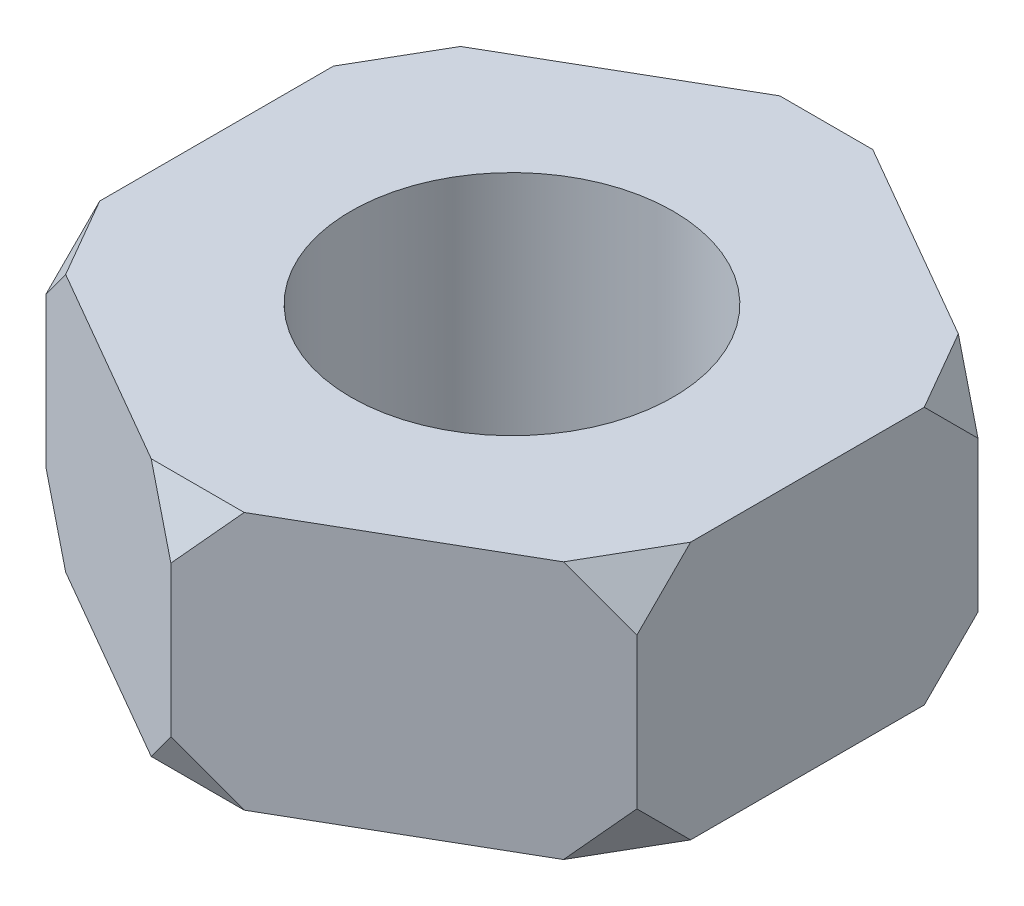
ISO-10303-21;
HEADER;
FILE_DESCRIPTION(('STEP AP214'),'2;1');
FILE_NAME('part.step','',(''),(''),'','','');
FILE_SCHEMA(('AUTOMOTIVE_DESIGN { 1 0 10303 214 1 1 1 1 }'));
ENDSEC;
DATA;
#1=APPLICATION_CONTEXT('core data for automotive mechanical design processes');
#2=APPLICATION_PROTOCOL_DEFINITION('international standard','automotive_design',2000,#1);
#3=PRODUCT_CONTEXT('',#1,'mechanical');
#4=PRODUCT('Part','Part','',(#3));
#5=PRODUCT_RELATED_PRODUCT_CATEGORY('part','',(#4));
#6=PRODUCT_DEFINITION_FORMATION('','',#4);
#7=PRODUCT_DEFINITION_CONTEXT('part definition',#1,'design');
#8=PRODUCT_DEFINITION('design','',#6,#7);
#9=PRODUCT_DEFINITION_SHAPE('','',#8);
#10=(LENGTH_UNIT() NAMED_UNIT(*) SI_UNIT(.MILLI.,.METRE.));
#11=(NAMED_UNIT(*) PLANE_ANGLE_UNIT() SI_UNIT($,.RADIAN.));
#12=(NAMED_UNIT(*) SI_UNIT($,.STERADIAN.) SOLID_ANGLE_UNIT());
#13=UNCERTAINTY_MEASURE_WITH_UNIT(LENGTH_MEASURE(1.E-05),#10,'distance_accuracy_value','');
#14=(GEOMETRIC_REPRESENTATION_CONTEXT(3) GLOBAL_UNCERTAINTY_ASSIGNED_CONTEXT((#13)) GLOBAL_UNIT_ASSIGNED_CONTEXT((#10,
#11,#12)) REPRESENTATION_CONTEXT('',''));
#15=CARTESIAN_POINT('',(0.,0.,0.));
#16=DIRECTION('',(0.,0.,1.));
#17=DIRECTION('',(1.,0.,0.));
#18=AXIS2_PLACEMENT_3D('',#15,#16,#17);
#19=CARTESIAN_POINT('',(2.75000000000002,2.4,1.58771324027145));
#20=DIRECTION('',(-1.,0.,0.));
#21=DIRECTION('',(0.,0.,1.));
#22=AXIS2_PLACEMENT_3D('',#19,#20,#21);
#23=PLANE('',#22);
#24=DIRECTION('',(0.,-1.,0.));
#25=VECTOR('',#24,1.);
#26=CARTESIAN_POINT('',(2.75000000000002,2.4,1.58771324027145));
#27=LINE('',#26,#25);
#28=CARTESIAN_POINT('',(2.75000000000002,1.9,1.58771324027145));
#29=VERTEX_POINT('',#28);
#30=CARTESIAN_POINT('',(2.75000000000002,0.500000000000003,1.58771324027145));
#31=VERTEX_POINT('',#30);
#32=EDGE_CURVE('E171',#29,#31,#27,.T.);
#33=ORIENTED_EDGE('',*,*,#32,.T.);
#34=DIRECTION('',(0.,-0.707106781186548,-0.707106781186547));
#35=VECTOR('',#34,1.);
#36=CARTESIAN_POINT('',(2.75000000000003,1.45,2.53771324027144));
#37=LINE('',#36,#35);
#38=CARTESIAN_POINT('',(2.75000000000001,0.,1.08771324027144));
#39=VERTEX_POINT('',#38);
#40=EDGE_CURVE('E11',#31,#39,#37,.T.);
#41=ORIENTED_EDGE('',*,*,#40,.T.);
#42=DIRECTION('',(0.,0.,-1.));
#43=VECTOR('',#42,1.);
#44=CARTESIAN_POINT('',(2.75000000000002,0.,1.58771324027145));
#45=LINE('',#44,#43);
#46=CARTESIAN_POINT('',(2.74999999999999,0.,-1.0877132402715));
#47=VERTEX_POINT('',#46);
#48=EDGE_CURVE('E330',#39,#47,#45,.T.);
#49=ORIENTED_EDGE('',*,*,#48,.T.);
#50=DIRECTION('',(0.,-0.707106781186547,0.707106781186548));
#51=VECTOR('',#50,1.);
#52=CARTESIAN_POINT('',(2.74999999999999,-0.137713240271475,-0.950000000000027));
#53=LINE('',#52,#51);
#54=CARTESIAN_POINT('',(2.74999999999998,0.500000000000003,-1.5877132402715));
#55=VERTEX_POINT('',#54);
#56=EDGE_CURVE('E321',#55,#47,#53,.T.);
#57=ORIENTED_EDGE('',*,*,#56,.F.);
#58=DIRECTION('',(0.,-1.,0.));
#59=VECTOR('',#58,1.);
#60=CARTESIAN_POINT('',(2.74999999999998,2.4,-1.5877132402715));
#61=LINE('',#60,#59);
#62=CARTESIAN_POINT('',(2.74999999999998,1.9,-1.5877132402715));
#63=VERTEX_POINT('',#62);
#64=EDGE_CURVE('E180',#63,#55,#61,.T.);
#65=ORIENTED_EDGE('',*,*,#64,.F.);
#66=DIRECTION('',(0.,-0.707106781186547,-0.707106781186548));
#67=VECTOR('',#66,1.);
#68=CARTESIAN_POINT('',(2.75,3.73771324027148,0.249999999999971));
#69=LINE('',#68,#67);
#70=CARTESIAN_POINT('',(2.74999999999999,2.4,-1.08771324027151));
#71=VERTEX_POINT('',#70);
#72=EDGE_CURVE('E254',#71,#63,#69,.T.);
#73=ORIENTED_EDGE('',*,*,#72,.F.);
#74=DIRECTION('',(0.,0.,-1.));
#75=VECTOR('',#74,1.);
#76=CARTESIAN_POINT('',(2.75000000000002,2.4,1.58771324027145));
#77=LINE('',#76,#75);
#78=CARTESIAN_POINT('',(2.75000000000001,2.4,1.08771324027144));
#79=VERTEX_POINT('',#78);
#80=EDGE_CURVE('E186',#79,#71,#77,.T.);
#81=ORIENTED_EDGE('',*,*,#80,.F.);
#82=DIRECTION('',(0.,0.707106781186548,-0.707106781186547));
#83=VECTOR('',#82,1.);
#84=CARTESIAN_POINT('',(2.75000000000001,2.15,1.33771324027145));
#85=LINE('',#84,#83);
#86=EDGE_CURVE('E177',#29,#79,#85,.T.);
#87=ORIENTED_EDGE('',*,*,#86,.F.);
#88=EDGE_LOOP('',(#33,#41,#49,#57,#65,#73,#81,#87));
#89=FACE_BOUND('',#88,.T.);
#90=ADVANCED_FACE('F39',(#89),#23,.F.);
#91=CARTESIAN_POINT('',(0.,2.4,3.17542648054294));
#92=DIRECTION('',(-0.500000000000007,0.,-0.866025403784435));
#93=DIRECTION('',(-0.866025403784435,0.,0.500000000000007));
#94=AXIS2_PLACEMENT_3D('',#91,#92,#93);
#95=PLANE('',#94);
#96=DIRECTION('',(0.866025403784435,0.,-0.500000000000007));
#97=VECTOR('',#96,1.);
#98=CARTESIAN_POINT('',(0.,0.,3.17542648054294));
#99=LINE('',#98,#97);
#100=CARTESIAN_POINT('',(0.433012701892239,0.,2.92542648054294));
#101=VERTEX_POINT('',#100);
#102=CARTESIAN_POINT('',(2.3169872981078,0.,1.83771324027145));
#103=VERTEX_POINT('',#102);
#104=EDGE_CURVE('E174',#101,#103,#99,.T.);
#105=ORIENTED_EDGE('',*,*,#104,.T.);
#106=DIRECTION('',(0.612372435695791,0.707106781186548,-0.353553390593278));
#107=VECTOR('',#106,1.);
#108=CARTESIAN_POINT('',(2.19772413359523,-0.137713240271472,1.90656986040719));
#109=LINE('',#108,#107);
#110=EDGE_CURVE('E48',#103,#31,#109,.T.);
#111=ORIENTED_EDGE('',*,*,#110,.T.);
#112=ORIENTED_EDGE('',*,*,#32,.F.);
#113=DIRECTION('',(0.612372435695791,-0.707106781186548,-0.353553390593278));
#114=VECTOR('',#113,1.);
#115=CARTESIAN_POINT('',(1.15849364905391,3.73771324027147,2.5065698604072));
#116=LINE('',#115,#114);
#117=CARTESIAN_POINT('',(2.3169872981078,2.4,1.83771324027145));
#118=VERTEX_POINT('',#117);
#119=EDGE_CURVE('E262',#118,#29,#116,.T.);
#120=ORIENTED_EDGE('',*,*,#119,.F.);
#121=DIRECTION('',(0.866025403784435,0.,-0.500000000000007));
#122=VECTOR('',#121,1.);
#123=CARTESIAN_POINT('',(0.,2.4,3.17542648054294));
#124=LINE('',#123,#122);
#125=CARTESIAN_POINT('',(0.433012701892241,2.4,2.92542648054294));
#126=VERTEX_POINT('',#125);
#127=EDGE_CURVE('E354',#126,#118,#124,.T.);
#128=ORIENTED_EDGE('',*,*,#127,.F.);
#129=DIRECTION('',(0.612372435695792,0.707106781186547,-0.353553390593279));
#130=VECTOR('',#129,1.);
#131=CARTESIAN_POINT('',(0.216506350946131,2.15,3.05042648054294));
#132=LINE('',#131,#130);
#133=CARTESIAN_POINT('',(0.,1.9,3.17542648054294));
#134=VERTEX_POINT('',#133);
#135=EDGE_CURVE('E207',#134,#126,#132,.T.);
#136=ORIENTED_EDGE('',*,*,#135,.F.);
#137=DIRECTION('',(0.,-1.,0.));
#138=VECTOR('',#137,1.);
#139=CARTESIAN_POINT('',(0.,2.4,3.17542648054294));
#140=LINE('',#139,#138);
#141=CARTESIAN_POINT('',(0.,0.499999999999999,3.17542648054294));
#142=VERTEX_POINT('',#141);
#143=EDGE_CURVE('E179',#134,#142,#140,.T.);
#144=ORIENTED_EDGE('',*,*,#143,.T.);
#145=DIRECTION('',(-0.612372435695792,0.707106781186547,0.353553390593279));
#146=VECTOR('',#145,1.);
#147=CARTESIAN_POINT('',(-0.822724133595191,1.45,3.65042648054295));
#148=LINE('',#147,#146);
#149=EDGE_CURVE('E275',#101,#142,#148,.T.);
#150=ORIENTED_EDGE('',*,*,#149,.F.);
#151=EDGE_LOOP('',(#105,#111,#112,#120,#128,#136,#144,#150));
#152=FACE_BOUND('',#151,.T.);
#153=ADVANCED_FACE('F170',(#152),#95,.F.);
#154=CARTESIAN_POINT('',(0.,0.,0.));
#155=DIRECTION('',(0.,1.,0.));
#156=DIRECTION('',(0.,0.,1.));
#157=AXIS2_PLACEMENT_3D('',#154,#155,#156);
#158=PLANE('',#157);
#159=CARTESIAN_POINT('',(0.,0.,0.));
#160=DIRECTION('',(0.,1.,0.));
#161=DIRECTION('',(0.,0.,1.));
#162=AXIS2_PLACEMENT_3D('',#159,#160,#161);
#163=CIRCLE('',#162,1.5);
#164=CARTESIAN_POINT('',(0.,0.,1.5));
#165=VERTEX_POINT('',#164);
#166=EDGE_CURVE('E366',#165,#165,#163,.T.);
#167=ORIENTED_EDGE('',*,*,#166,.T.);
#168=EDGE_LOOP('',(#167));
#169=FACE_BOUND('',#168,.T.);
#170=ORIENTED_EDGE('',*,*,#48,.F.);
#171=DIRECTION('',(-0.499999999999992,0.,0.866025403784443));
#172=VECTOR('',#171,1.);
#173=CARTESIAN_POINT('',(2.53349364905391,0.,1.46271324027145));
#174=LINE('',#173,#172);
#175=EDGE_CURVE('E55',#39,#103,#174,.T.);
#176=ORIENTED_EDGE('',*,*,#175,.T.);
#177=ORIENTED_EDGE('',*,*,#104,.F.);
#178=DIRECTION('',(1.,0.,0.));
#179=VECTOR('',#178,1.);
#180=CARTESIAN_POINT('',(0.,0.,2.92542648054294));
#181=LINE('',#180,#179);
#182=CARTESIAN_POINT('',(-0.433012701892199,0.,2.92542648054295));
#183=VERTEX_POINT('',#182);
#184=EDGE_CURVE('E267',#183,#101,#181,.T.);
#185=ORIENTED_EDGE('',*,*,#184,.F.);
#186=DIRECTION('',(0.866025403784442,0.,0.499999999999995));
#187=VECTOR('',#186,1.);
#188=CARTESIAN_POINT('',(-2.74999999999999,0.,1.58771324027148));
#189=LINE('',#188,#187);
#190=CARTESIAN_POINT('',(-2.31698729810777,0.,1.83771324027148));
#191=VERTEX_POINT('',#190);
#192=EDGE_CURVE('E337',#191,#183,#189,.T.);
#193=ORIENTED_EDGE('',*,*,#192,.F.);
#194=DIRECTION('',(0.500000000000004,0.,0.866025403784436));
#195=VECTOR('',#194,1.);
#196=CARTESIAN_POINT('',(-2.53349364905388,0.,1.46271324027148));
#197=LINE('',#196,#195);
#198=CARTESIAN_POINT('',(-2.75,0.,1.08771324027148));
#199=VERTEX_POINT('',#198);
#200=EDGE_CURVE('E279',#199,#191,#197,.T.);
#201=ORIENTED_EDGE('',*,*,#200,.F.);
#202=DIRECTION('',(0.,0.,1.));
#203=VECTOR('',#202,1.);
#204=CARTESIAN_POINT('',(-2.75000000000001,0.,-1.58771324027147));
#205=LINE('',#204,#203);
#206=CARTESIAN_POINT('',(-2.75,0.,-1.08771324027146));
#207=VERTEX_POINT('',#206);
#208=EDGE_CURVE('E342',#207,#199,#205,.T.);
#209=ORIENTED_EDGE('',*,*,#208,.F.);
#210=DIRECTION('',(-0.499999999999998,0.,0.86602540378444));
#211=VECTOR('',#210,1.);
#212=CARTESIAN_POINT('',(-2.53349364905389,0.,-1.46271324027147));
#213=LINE('',#212,#211);
#214=CARTESIAN_POINT('',(-2.31698729810778,0.,-1.83771324027147));
#215=VERTEX_POINT('',#214);
#216=EDGE_CURVE('E295',#215,#207,#213,.T.);
#217=ORIENTED_EDGE('',*,*,#216,.F.);
#218=DIRECTION('',(-0.866025403784438,0.,0.500000000000001));
#219=VECTOR('',#218,1.);
#220=CARTESIAN_POINT('',(0.,0.,-3.17542648054294));
#221=LINE('',#220,#219);
#222=CARTESIAN_POINT('',(-0.433012701892218,0.,-2.92542648054294));
#223=VERTEX_POINT('',#222);
#224=EDGE_CURVE('E345',#223,#215,#221,.T.);
#225=ORIENTED_EDGE('',*,*,#224,.F.);
#226=DIRECTION('',(-1.,0.,0.));
#227=VECTOR('',#226,1.);
#228=CARTESIAN_POINT('',(0.,0.,-2.92542648054294));
#229=LINE('',#228,#227);
#230=CARTESIAN_POINT('',(0.43301270189222,0.,-2.92542648054295));
#231=VERTEX_POINT('',#230);
#232=EDGE_CURVE('E311',#231,#223,#229,.T.);
#233=ORIENTED_EDGE('',*,*,#232,.F.);
#234=DIRECTION('',(-0.866025403784441,0.,-0.499999999999995));
#235=VECTOR('',#234,1.);
#236=CARTESIAN_POINT('',(2.74999999999998,0.,-1.5877132402715));
#237=LINE('',#236,#235);
#238=CARTESIAN_POINT('',(2.31698729810776,0.,-1.8377132402715));
#239=VERTEX_POINT('',#238);
#240=EDGE_CURVE('E348',#239,#231,#237,.T.);
#241=ORIENTED_EDGE('',*,*,#240,.F.);
#242=DIRECTION('',(-0.500000000000007,0.,-0.866025403784434));
#243=VECTOR('',#242,1.);
#244=CARTESIAN_POINT('',(2.53349364905388,0.,-1.46271324027149));
#245=LINE('',#244,#243);
#246=EDGE_CURVE('E317',#47,#239,#245,.T.);
#247=ORIENTED_EDGE('',*,*,#246,.F.);
#248=EDGE_LOOP('',(#170,#176,#177,#185,#193,#201,#209,#217,#225,#233,#241,#247));
#249=FACE_BOUND('',#248,.T.);
#250=ADVANCED_FACE('F327',(#169,#249),#158,.F.);
#251=CARTESIAN_POINT('',(0.,2.4,0.));
#252=DIRECTION('',(0.,1.,0.));
#253=DIRECTION('',(0.,0.,1.));
#254=AXIS2_PLACEMENT_3D('',#251,#252,#253);
#255=PLANE('',#254);
#256=CARTESIAN_POINT('',(0.,2.4,0.));
#257=DIRECTION('',(0.,1.,0.));
#258=DIRECTION('',(0.,0.,1.));
#259=AXIS2_PLACEMENT_3D('',#256,#257,#258);
#260=CIRCLE('',#259,1.5);
#261=CARTESIAN_POINT('',(0.,2.4,1.5));
#262=VERTEX_POINT('',#261);
#263=EDGE_CURVE('E351',#262,#262,#260,.T.);
#264=ORIENTED_EDGE('',*,*,#263,.F.);
#265=EDGE_LOOP('',(#264));
#266=FACE_BOUND('',#265,.T.);
#267=ORIENTED_EDGE('',*,*,#127,.T.);
#268=DIRECTION('',(0.499999999999992,0.,-0.866025403784443));
#269=VECTOR('',#268,1.);
#270=CARTESIAN_POINT('',(2.5334936490539,2.4,1.46271324027145));
#271=LINE('',#270,#269);
#272=EDGE_CURVE('E258',#118,#79,#271,.T.);
#273=ORIENTED_EDGE('',*,*,#272,.T.);
#274=ORIENTED_EDGE('',*,*,#80,.T.);
#275=DIRECTION('',(-0.500000000000007,0.,-0.866025403784434));
#276=VECTOR('',#275,1.);
#277=CARTESIAN_POINT('',(2.53349364905388,2.4,-1.46271324027149));
#278=LINE('',#277,#276);
#279=CARTESIAN_POINT('',(2.31698729810776,2.4,-1.8377132402715));
#280=VERTEX_POINT('',#279);
#281=EDGE_CURVE('E251',#71,#280,#278,.T.);
#282=ORIENTED_EDGE('',*,*,#281,.T.);
#283=DIRECTION('',(-0.866025403784441,0.,-0.499999999999995));
#284=VECTOR('',#283,1.);
#285=CARTESIAN_POINT('',(2.74999999999998,2.4,-1.5877132402715));
#286=LINE('',#285,#284);
#287=CARTESIAN_POINT('',(0.433012701892222,2.4,-2.92542648054294));
#288=VERTEX_POINT('',#287);
#289=EDGE_CURVE('E332',#280,#288,#286,.T.);
#290=ORIENTED_EDGE('',*,*,#289,.T.);
#291=DIRECTION('',(1.,0.,0.));
#292=VECTOR('',#291,1.);
#293=CARTESIAN_POINT('',(0.,2.4,-2.92542648054294));
#294=LINE('',#293,#292);
#295=CARTESIAN_POINT('',(-0.43301270189222,2.4,-2.92542648054294));
#296=VERTEX_POINT('',#295);
#297=EDGE_CURVE('E235',#296,#288,#294,.T.);
#298=ORIENTED_EDGE('',*,*,#297,.F.);
#299=DIRECTION('',(-0.866025403784438,0.,0.500000000000001));
#300=VECTOR('',#299,1.);
#301=CARTESIAN_POINT('',(0.,2.4,-3.17542648054294));
#302=LINE('',#301,#300);
#303=CARTESIAN_POINT('',(-2.31698729810779,2.4,-1.83771324027147));
#304=VERTEX_POINT('',#303);
#305=EDGE_CURVE('E335',#296,#304,#302,.T.);
#306=ORIENTED_EDGE('',*,*,#305,.T.);
#307=DIRECTION('',(-0.499999999999998,0.,0.86602540378444));
#308=VECTOR('',#307,1.);
#309=CARTESIAN_POINT('',(-2.53349364905389,2.4,-1.46271324027147));
#310=LINE('',#309,#308);
#311=CARTESIAN_POINT('',(-2.75,2.4,-1.08771324027146));
#312=VERTEX_POINT('',#311);
#313=EDGE_CURVE('E223',#304,#312,#310,.T.);
#314=ORIENTED_EDGE('',*,*,#313,.T.);
#315=DIRECTION('',(0.,0.,1.));
#316=VECTOR('',#315,1.);
#317=CARTESIAN_POINT('',(-2.75000000000001,2.4,-1.58771324027147));
#318=LINE('',#317,#316);
#319=CARTESIAN_POINT('',(-2.75,2.4,1.08771324027149));
#320=VERTEX_POINT('',#319);
#321=EDGE_CURVE('E361',#312,#320,#318,.T.);
#322=ORIENTED_EDGE('',*,*,#321,.T.);
#323=DIRECTION('',(0.500000000000004,0.,0.866025403784436));
#324=VECTOR('',#323,1.);
#325=CARTESIAN_POINT('',(-2.53349364905388,2.4,1.46271324027148));
#326=LINE('',#325,#324);
#327=CARTESIAN_POINT('',(-2.31698729810777,2.4,1.83771324027148));
#328=VERTEX_POINT('',#327);
#329=EDGE_CURVE('E211',#320,#328,#326,.T.);
#330=ORIENTED_EDGE('',*,*,#329,.T.);
#331=DIRECTION('',(0.866025403784442,0.,0.499999999999995));
#332=VECTOR('',#331,1.);
#333=CARTESIAN_POINT('',(-2.74999999999999,2.4,1.58771324027148));
#334=LINE('',#333,#332);
#335=CARTESIAN_POINT('',(-0.433012701892199,2.4,2.92542648054295));
#336=VERTEX_POINT('',#335);
#337=EDGE_CURVE('E358',#328,#336,#334,.T.);
#338=ORIENTED_EDGE('',*,*,#337,.T.);
#339=DIRECTION('',(1.,0.,0.));
#340=VECTOR('',#339,1.);
#341=CARTESIAN_POINT('',(0.,2.4,2.92542648054294));
#342=LINE('',#341,#340);
#343=EDGE_CURVE('E199',#336,#126,#342,.T.);
#344=ORIENTED_EDGE('',*,*,#343,.T.);
#345=EDGE_LOOP('',(#267,#273,#274,#282,#290,#298,#306,#314,#322,#330,#338,#344));
#346=FACE_BOUND('',#345,.T.);
#347=ADVANCED_FACE('F377',(#266,#346),#255,.T.);
#348=CARTESIAN_POINT('',(0.,2.4,-3.17542648054294));
#349=DIRECTION('',(0.500000000000001,0.,0.866025403784438));
#350=DIRECTION('',(0.866025403784438,0.,-0.500000000000001));
#351=AXIS2_PLACEMENT_3D('',#348,#349,#350);
#352=PLANE('',#351);
#353=DIRECTION('',(0.612372435695794,0.707106781186547,-0.353553390593275));
#354=VECTOR('',#353,1.);
#355=CARTESIAN_POINT('',(0.822724133595216,1.45,-3.65042648054294));
#356=LINE('',#355,#354);
#357=CARTESIAN_POINT('',(0.,0.499999999999999,-3.17542648054294));
#358=VERTEX_POINT('',#357);
#359=EDGE_CURVE('E303',#223,#358,#356,.T.);
#360=ORIENTED_EDGE('',*,*,#359,.F.);
#361=ORIENTED_EDGE('',*,*,#224,.T.);
#362=DIRECTION('',(0.612372435695794,-0.707106781186547,-0.353553390593275));
#363=VECTOR('',#362,1.);
#364=CARTESIAN_POINT('',(-2.19772413359522,-0.137713240271477,-1.9065698604072));
#365=LINE('',#364,#363);
#366=CARTESIAN_POINT('',(-2.75000000000001,0.500000000000001,-1.58771324027147));
#367=VERTEX_POINT('',#366);
#368=EDGE_CURVE('E291',#367,#215,#365,.T.);
#369=ORIENTED_EDGE('',*,*,#368,.F.);
#370=DIRECTION('',(0.,-1.,0.));
#371=VECTOR('',#370,1.);
#372=CARTESIAN_POINT('',(-2.75000000000001,2.4,-1.58771324027147));
#373=LINE('',#372,#371);
#374=CARTESIAN_POINT('',(-2.75000000000001,1.9,-1.58771324027147));
#375=VERTEX_POINT('',#374);
#376=EDGE_CURVE('E192',#375,#367,#373,.T.);
#377=ORIENTED_EDGE('',*,*,#376,.F.);
#378=DIRECTION('',(-0.612372435695794,-0.707106781186547,0.353553390593275));
#379=VECTOR('',#378,1.);
#380=CARTESIAN_POINT('',(-1.15849364905389,3.73771324027147,-2.50656986040721));
#381=LINE('',#380,#379);
#382=EDGE_CURVE('E227',#304,#375,#381,.T.);
#383=ORIENTED_EDGE('',*,*,#382,.F.);
#384=ORIENTED_EDGE('',*,*,#305,.F.);
#385=DIRECTION('',(0.612372435695794,-0.707106781186548,-0.353553390593275));
#386=VECTOR('',#385,1.);
#387=CARTESIAN_POINT('',(-0.21650635094611,2.15,-3.05042648054294));
#388=LINE('',#387,#386);
#389=CARTESIAN_POINT('',(0.,1.9,-3.17542648054294));
#390=VERTEX_POINT('',#389);
#391=EDGE_CURVE('E243',#296,#390,#388,.T.);
#392=ORIENTED_EDGE('',*,*,#391,.T.);
#393=DIRECTION('',(0.,-1.,0.));
#394=VECTOR('',#393,1.);
#395=CARTESIAN_POINT('',(0.,2.4,-3.17542648054294));
#396=LINE('',#395,#394);
#397=EDGE_CURVE('E195',#390,#358,#396,.T.);
#398=ORIENTED_EDGE('',*,*,#397,.T.);
#399=EDGE_LOOP('',(#360,#361,#369,#377,#383,#384,#392,#398));
#400=FACE_BOUND('',#399,.T.);
#401=ADVANCED_FACE('F380',(#400),#352,.F.);
#402=CARTESIAN_POINT('',(2.74999999999998,2.4,-1.5877132402715));
#403=DIRECTION('',(-0.499999999999995,0.,0.866025403784441));
#404=DIRECTION('',(0.866025403784442,0.,0.499999999999995));
#405=AXIS2_PLACEMENT_3D('',#402,#403,#404);
#406=PLANE('',#405);
#407=DIRECTION('',(0.612372435695797,0.707106781186547,0.35355339059327));
#408=VECTOR('',#407,1.);
#409=CARTESIAN_POINT('',(3.5727241335952,1.45,-1.11271324027151));
#410=LINE('',#409,#408);
#411=EDGE_CURVE('E62',#239,#55,#410,.T.);
#412=ORIENTED_EDGE('',*,*,#411,.F.);
#413=ORIENTED_EDGE('',*,*,#240,.T.);
#414=DIRECTION('',(0.612372435695797,-0.707106781186547,0.35355339059327));
#415=VECTOR('',#414,1.);
#416=CARTESIAN_POINT('',(0.552275866404773,-0.137713240271457,-2.85656986040722));
#417=LINE('',#416,#415);
#418=EDGE_CURVE('E307',#358,#231,#417,.T.);
#419=ORIENTED_EDGE('',*,*,#418,.F.);
#420=ORIENTED_EDGE('',*,*,#397,.F.);
#421=DIRECTION('',(0.612372435695797,0.707106781186547,0.35355339059327));
#422=VECTOR('',#421,1.);
#423=CARTESIAN_POINT('',(1.5915063509461,3.73771324027145,-2.25656986040722));
#424=LINE('',#423,#422);
#425=EDGE_CURVE('E239',#390,#288,#424,.T.);
#426=ORIENTED_EDGE('',*,*,#425,.T.);
#427=ORIENTED_EDGE('',*,*,#289,.F.);
#428=DIRECTION('',(-0.612372435695797,0.707106781186547,-0.35355339059327));
#429=VECTOR('',#428,1.);
#430=CARTESIAN_POINT('',(2.53349364905387,2.15,-1.7127132402715));
#431=LINE('',#430,#429);
#432=EDGE_CURVE('E247',#63,#280,#431,.T.);
#433=ORIENTED_EDGE('',*,*,#432,.F.);
#434=ORIENTED_EDGE('',*,*,#64,.T.);
#435=EDGE_LOOP('',(#412,#413,#419,#420,#426,#427,#433,#434));
#436=FACE_BOUND('',#435,.T.);
#437=ADVANCED_FACE('F41',(#436),#406,.F.);
#438=CARTESIAN_POINT('',(-2.75000000000001,2.4,-1.58771324027147));
#439=DIRECTION('',(1.,0.,0.));
#440=DIRECTION('',(0.,0.,-1.));
#441=AXIS2_PLACEMENT_3D('',#438,#439,#440);
#442=PLANE('',#441);
#443=DIRECTION('',(0.,0.707106781186548,-0.707106781186547));
#444=VECTOR('',#443,1.);
#445=CARTESIAN_POINT('',(-2.75000000000001,1.45,-2.53771324027146));
#446=LINE('',#445,#444);
#447=EDGE_CURVE('E299',#207,#367,#446,.T.);
#448=ORIENTED_EDGE('',*,*,#447,.F.);
#449=ORIENTED_EDGE('',*,*,#208,.T.);
#450=DIRECTION('',(0.,-0.707106781186547,-0.707106781186548));
#451=VECTOR('',#450,1.);
#452=CARTESIAN_POINT('',(-2.75,-0.137713240271475,0.950000000000008));
#453=LINE('',#452,#451);
#454=CARTESIAN_POINT('',(-2.74999999999999,0.5,1.58771324027148));
#455=VERTEX_POINT('',#454);
#456=EDGE_CURVE('E283',#455,#199,#453,.T.);
#457=ORIENTED_EDGE('',*,*,#456,.F.);
#458=DIRECTION('',(0.,-1.,0.));
#459=VECTOR('',#458,1.);
#460=CARTESIAN_POINT('',(-2.74999999999999,2.4,1.58771324027148));
#461=LINE('',#460,#459);
#462=CARTESIAN_POINT('',(-2.74999999999999,1.9,1.58771324027148));
#463=VERTEX_POINT('',#462);
#464=EDGE_CURVE('E184',#463,#455,#461,.T.);
#465=ORIENTED_EDGE('',*,*,#464,.F.);
#466=DIRECTION('',(0.,-0.707106781186547,0.707106781186548));
#467=VECTOR('',#466,1.);
#468=CARTESIAN_POINT('',(-2.75,3.73771324027147,-0.24999999999999));
#469=LINE('',#468,#467);
#470=EDGE_CURVE('E215',#320,#463,#469,.T.);
#471=ORIENTED_EDGE('',*,*,#470,.F.);
#472=ORIENTED_EDGE('',*,*,#321,.F.);
#473=DIRECTION('',(0.,0.707106781186548,0.707106781186547));
#474=VECTOR('',#473,1.);
#475=CARTESIAN_POINT('',(-2.75,2.15,-1.33771324027146));
#476=LINE('',#475,#474);
#477=EDGE_CURVE('E231',#375,#312,#476,.T.);
#478=ORIENTED_EDGE('',*,*,#477,.F.);
#479=ORIENTED_EDGE('',*,*,#376,.T.);
#480=EDGE_LOOP('',(#448,#449,#457,#465,#471,#472,#478,#479));
#481=FACE_BOUND('',#480,.T.);
#482=ADVANCED_FACE('F411',(#481),#442,.F.);
#483=CARTESIAN_POINT('',(-2.74999999999999,2.4,1.58771324027148));
#484=DIRECTION('',(0.499999999999995,0.,-0.866025403784441));
#485=DIRECTION('',(-0.866025403784441,0.,-0.499999999999995));
#486=AXIS2_PLACEMENT_3D('',#483,#484,#485);
#487=PLANE('',#486);
#488=DIRECTION('',(-0.612372435695797,0.707106781186547,-0.35355339059327));
#489=VECTOR('',#488,1.);
#490=CARTESIAN_POINT('',(-3.57272413359521,1.45,1.11271324027149));
#491=LINE('',#490,#489);
#492=EDGE_CURVE('E287',#191,#455,#491,.T.);
#493=ORIENTED_EDGE('',*,*,#492,.F.);
#494=ORIENTED_EDGE('',*,*,#192,.T.);
#495=DIRECTION('',(-0.612372435695797,-0.707106781186547,-0.35355339059327));
#496=VECTOR('',#495,1.);
#497=CARTESIAN_POINT('',(-0.552275866404767,-0.137713240271475,2.85656986040721));
#498=LINE('',#497,#496);
#499=EDGE_CURVE('E271',#142,#183,#498,.T.);
#500=ORIENTED_EDGE('',*,*,#499,.F.);
#501=ORIENTED_EDGE('',*,*,#143,.F.);
#502=DIRECTION('',(0.612372435695797,-0.707106781186548,0.35355339059327));
#503=VECTOR('',#502,1.);
#504=CARTESIAN_POINT('',(-1.5915063509461,3.73771324027147,2.25656986040722));
#505=LINE('',#504,#503);
#506=EDGE_CURVE('E203',#336,#134,#505,.T.);
#507=ORIENTED_EDGE('',*,*,#506,.F.);
#508=ORIENTED_EDGE('',*,*,#337,.F.);
#509=DIRECTION('',(0.612372435695797,0.707106781186547,0.35355339059327));
#510=VECTOR('',#509,1.);
#511=CARTESIAN_POINT('',(-2.53349364905388,2.15,1.71271324027148));
#512=LINE('',#511,#510);
#513=EDGE_CURVE('E219',#463,#328,#512,.T.);
#514=ORIENTED_EDGE('',*,*,#513,.F.);
#515=ORIENTED_EDGE('',*,*,#464,.T.);
#516=EDGE_LOOP('',(#493,#494,#500,#501,#507,#508,#514,#515));
#517=FACE_BOUND('',#516,.T.);
#518=ADVANCED_FACE('F408',(#517),#487,.F.);
#519=CARTESIAN_POINT('',(0.,2.4,0.));
#520=DIRECTION('',(0.,-1.,0.));
#521=DIRECTION('',(0.,0.,-1.));
#522=AXIS2_PLACEMENT_3D('',#519,#520,#521);
#523=CYLINDRICAL_SURFACE('',#522,1.5);
#524=ORIENTED_EDGE('',*,*,#263,.T.);
#525=EDGE_LOOP('',(#524));
#526=FACE_BOUND('',#525,.T.);
#527=ORIENTED_EDGE('',*,*,#166,.F.);
#528=EDGE_LOOP('',(#527));
#529=FACE_BOUND('',#528,.T.);
#530=ADVANCED_FACE('F374',(#526,#529),#523,.F.);
#531=CARTESIAN_POINT('',(0.,1.65017059221718,3.30034118443435));
#532=DIRECTION('',(0.,0.447213595499959,0.894427190999915));
#533=DIRECTION('',(0.,-0.894427190999916,0.447213595499959));
#534=AXIS2_PLACEMENT_3D('',#531,#532,#533);
#535=PLANE('',#534);
#536=ORIENTED_EDGE('',*,*,#343,.F.);
#537=ORIENTED_EDGE('',*,*,#506,.T.);
#538=ORIENTED_EDGE('',*,*,#135,.T.);
#539=EDGE_LOOP('',(#536,#537,#538));
#540=FACE_BOUND('',#539,.T.);
#541=ADVANCED_FACE('F452',(#540),#535,.T.);
#542=CARTESIAN_POINT('',(-2.85817930687617,1.65017059221718,1.65017059221719));
#543=DIRECTION('',(-0.774596669241481,0.447213595499959,0.447213595499961));
#544=DIRECTION('',(0.500000000000004,0.,0.866025403784436));
#545=AXIS2_PLACEMENT_3D('',#542,#543,#544);
#546=PLANE('',#545);
#547=ORIENTED_EDGE('',*,*,#329,.F.);
#548=ORIENTED_EDGE('',*,*,#470,.T.);
#549=ORIENTED_EDGE('',*,*,#513,.T.);
#550=EDGE_LOOP('',(#547,#548,#549));
#551=FACE_BOUND('',#550,.T.);
#552=ADVANCED_FACE('F447',(#551),#546,.T.);
#553=CARTESIAN_POINT('',(-2.85817930687618,1.65017059221718,-1.65017059221717));
#554=DIRECTION('',(-0.774596669241484,0.447213595499959,-0.447213595499956));
#555=DIRECTION('',(-0.500000000000001,-0.866025403784438,0.));
#556=AXIS2_PLACEMENT_3D('',#553,#554,#555);
#557=PLANE('',#556);
#558=ORIENTED_EDGE('',*,*,#313,.F.);
#559=ORIENTED_EDGE('',*,*,#382,.T.);
#560=ORIENTED_EDGE('',*,*,#477,.T.);
#561=EDGE_LOOP('',(#558,#559,#560));
#562=FACE_BOUND('',#561,.T.);
#563=ADVANCED_FACE('F436',(#562),#557,.T.);
#564=CARTESIAN_POINT('',(0.,1.65017059221717,-3.30034118443436));
#565=DIRECTION('',(0.,-0.447213595499957,0.894427190999917));
#566=DIRECTION('',(0.,-0.894427190999917,-0.447213595499957));
#567=AXIS2_PLACEMENT_3D('',#564,#565,#566);
#568=PLANE('',#567);
#569=ORIENTED_EDGE('',*,*,#391,.F.);
#570=ORIENTED_EDGE('',*,*,#297,.T.);
#571=ORIENTED_EDGE('',*,*,#425,.F.);
#572=EDGE_LOOP('',(#569,#570,#571));
#573=FACE_BOUND('',#572,.T.);
#574=ADVANCED_FACE('F397',(#573),#568,.F.);
#575=CARTESIAN_POINT('',(2.85817930687616,1.65017059221717,-1.6501705922172));
#576=DIRECTION('',(0.77459666924148,0.447213595499957,-0.447213595499965));
#577=DIRECTION('',(-0.500000000000007,0.,-0.866025403784434));
#578=AXIS2_PLACEMENT_3D('',#575,#576,#577);
#579=PLANE('',#578);
#580=ORIENTED_EDGE('',*,*,#72,.T.);
#581=ORIENTED_EDGE('',*,*,#432,.T.);
#582=ORIENTED_EDGE('',*,*,#281,.F.);
#583=EDGE_LOOP('',(#580,#581,#582));
#584=FACE_BOUND('',#583,.T.);
#585=ADVANCED_FACE('F388',(#584),#579,.T.);
#586=CARTESIAN_POINT('',(2.85817930687619,1.65017059221718,1.65017059221715));
#587=DIRECTION('',(0.774596669241487,0.447213595499958,0.44721359549995));
#588=DIRECTION('',(-0.499999999999998,0.866025403784439,0.));
#589=AXIS2_PLACEMENT_3D('',#586,#587,#588);
#590=PLANE('',#589);
#591=ORIENTED_EDGE('',*,*,#272,.F.);
#592=ORIENTED_EDGE('',*,*,#119,.T.);
#593=ORIENTED_EDGE('',*,*,#86,.T.);
#594=EDGE_LOOP('',(#591,#592,#593));
#595=FACE_BOUND('',#594,.T.);
#596=ADVANCED_FACE('F385',(#595),#590,.T.);
#597=CARTESIAN_POINT('',(0.,-1.17017059221718,2.34034118443435));
#598=DIRECTION('',(0.,-0.447213595499959,0.894427190999915));
#599=DIRECTION('',(0.,-0.894427190999915,-0.447213595499959));
#600=AXIS2_PLACEMENT_3D('',#597,#598,#599);
#601=PLANE('',#600);
#602=ORIENTED_EDGE('',*,*,#499,.T.);
#603=ORIENTED_EDGE('',*,*,#184,.T.);
#604=ORIENTED_EDGE('',*,*,#149,.T.);
#605=EDGE_LOOP('',(#602,#603,#604));
#606=FACE_BOUND('',#605,.T.);
#607=ADVANCED_FACE('F387',(#606),#601,.T.);
#608=CARTESIAN_POINT('',(-2.0267949192431,-1.17017059221718,1.17017059221719));
#609=DIRECTION('',(-0.774596669241481,-0.447213595499959,0.447213595499961));
#610=DIRECTION('',(0.500000000000004,0.,0.866025403784436));
#611=AXIS2_PLACEMENT_3D('',#608,#609,#610);
#612=PLANE('',#611);
#613=ORIENTED_EDGE('',*,*,#456,.T.);
#614=ORIENTED_EDGE('',*,*,#200,.T.);
#615=ORIENTED_EDGE('',*,*,#492,.T.);
#616=EDGE_LOOP('',(#613,#614,#615));
#617=FACE_BOUND('',#616,.T.);
#618=ADVANCED_FACE('F394',(#617),#612,.T.);
#619=CARTESIAN_POINT('',(-2.02679491924311,-1.17017059221718,-1.17017059221717));
#620=DIRECTION('',(-0.774596669241484,-0.447213595499959,-0.447213595499956));
#621=DIRECTION('',(0.500000000000001,-0.866025403784438,0.));
#622=AXIS2_PLACEMENT_3D('',#619,#620,#621);
#623=PLANE('',#622);
#624=ORIENTED_EDGE('',*,*,#447,.T.);
#625=ORIENTED_EDGE('',*,*,#368,.T.);
#626=ORIENTED_EDGE('',*,*,#216,.T.);
#627=EDGE_LOOP('',(#624,#625,#626));
#628=FACE_BOUND('',#627,.T.);
#629=ADVANCED_FACE('F430',(#628),#623,.T.);
#630=CARTESIAN_POINT('',(0.,-1.17017059221718,-2.34034118443436));
#631=DIRECTION('',(0.,-0.447213595499957,-0.894427190999917));
#632=DIRECTION('',(0.,0.894427190999917,-0.447213595499957));
#633=AXIS2_PLACEMENT_3D('',#630,#631,#632);
#634=PLANE('',#633);
#635=ORIENTED_EDGE('',*,*,#232,.T.);
#636=ORIENTED_EDGE('',*,*,#359,.T.);
#637=ORIENTED_EDGE('',*,*,#418,.T.);
#638=EDGE_LOOP('',(#635,#636,#637));
#639=FACE_BOUND('',#638,.T.);
#640=ADVANCED_FACE('F426',(#639),#634,.T.);
#641=CARTESIAN_POINT('',(2.02679491924311,-1.17017059221718,-1.1701705922172));
#642=DIRECTION('',(0.77459666924148,-0.447213595499957,-0.447213595499965));
#643=DIRECTION('',(-0.500000000000007,0.,-0.866025403784434));
#644=AXIS2_PLACEMENT_3D('',#641,#642,#643);
#645=PLANE('',#644);
#646=ORIENTED_EDGE('',*,*,#246,.T.);
#647=ORIENTED_EDGE('',*,*,#411,.T.);
#648=ORIENTED_EDGE('',*,*,#56,.T.);
#649=EDGE_LOOP('',(#646,#647,#648));
#650=FACE_BOUND('',#649,.T.);
#651=ADVANCED_FACE('F542',(#650),#645,.T.);
#652=CARTESIAN_POINT('',(2.02679491924312,-1.17017059221718,1.17017059221716));
#653=DIRECTION('',(-0.774596669241487,0.447213595499958,-0.44721359549995));
#654=DIRECTION('',(-0.499999999999998,-0.866025403784439,0.));
#655=AXIS2_PLACEMENT_3D('',#652,#653,#654);
#656=PLANE('',#655);
#657=ORIENTED_EDGE('',*,*,#175,.F.);
#658=ORIENTED_EDGE('',*,*,#40,.F.);
#659=ORIENTED_EDGE('',*,*,#110,.F.);
#660=EDGE_LOOP('',(#657,#658,#659));
#661=FACE_BOUND('',#660,.T.);
#662=ADVANCED_FACE('F163',(#661),#656,.F.);
#663=CLOSED_SHELL('',(#90,#153,#250,#347,#401,#437,#482,#518,#530,#541,#552,#563,#574,#585,#596,
#607,#618,#629,#640,#651,#662));
#664=MANIFOLD_SOLID_BREP('B2',#663);
#665=ADVANCED_BREP_SHAPE_REPRESENTATION('',(#18,#664),#14);
#666=SHAPE_DEFINITION_REPRESENTATION(#9,#665);
ENDSEC;
END-ISO-10303-21;
